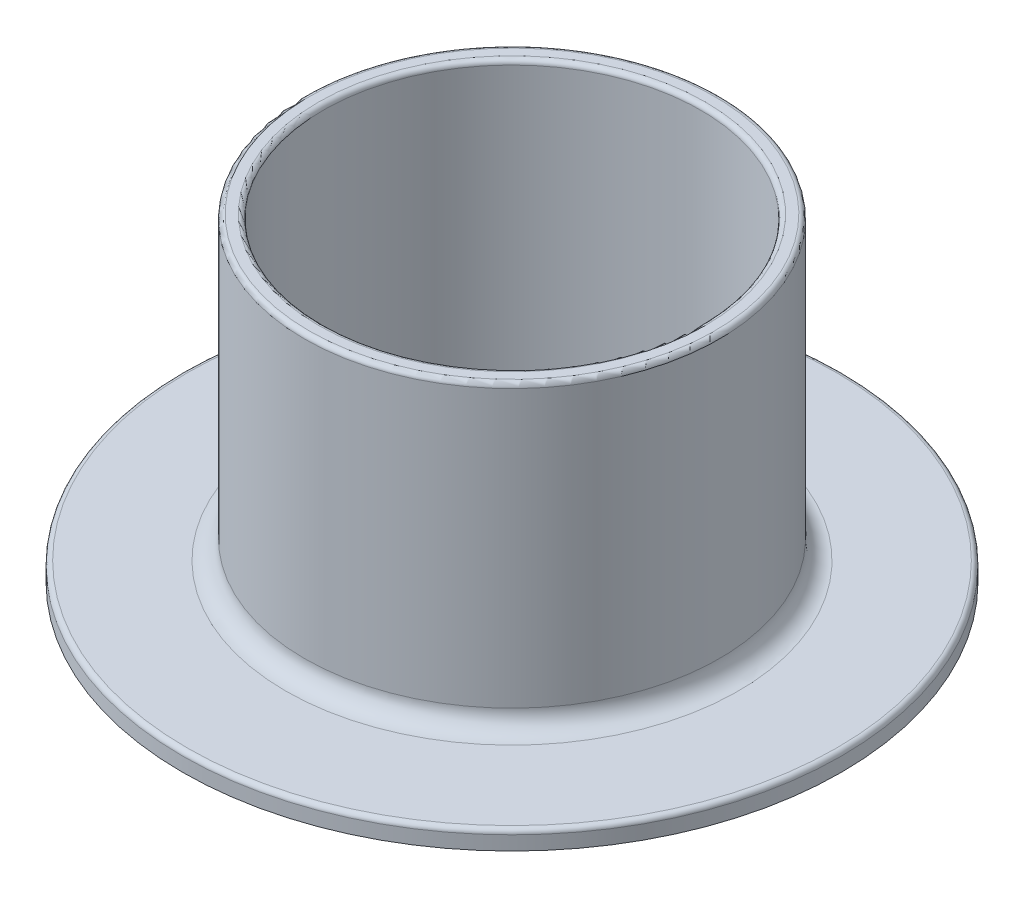
ISO-10303-21;
HEADER;
FILE_DESCRIPTION(('STEP AP214'),'2;1');
FILE_NAME('part.step','',(''),(''),'','','');
FILE_SCHEMA(('AUTOMOTIVE_DESIGN { 1 0 10303 214 1 1 1 1 }'));
ENDSEC;
DATA;
#1=APPLICATION_CONTEXT('core data for automotive mechanical design processes');
#2=APPLICATION_PROTOCOL_DEFINITION('international standard','automotive_design',2000,#1);
#3=PRODUCT_CONTEXT('',#1,'mechanical');
#4=PRODUCT('Part','Part','',(#3));
#5=PRODUCT_RELATED_PRODUCT_CATEGORY('part','',(#4));
#6=PRODUCT_DEFINITION_FORMATION('','',#4);
#7=PRODUCT_DEFINITION_CONTEXT('part definition',#1,'design');
#8=PRODUCT_DEFINITION('design','',#6,#7);
#9=PRODUCT_DEFINITION_SHAPE('','',#8);
#10=(LENGTH_UNIT() NAMED_UNIT(*) SI_UNIT(.MILLI.,.METRE.));
#11=(NAMED_UNIT(*) PLANE_ANGLE_UNIT() SI_UNIT($,.RADIAN.));
#12=(NAMED_UNIT(*) SI_UNIT($,.STERADIAN.) SOLID_ANGLE_UNIT());
#13=UNCERTAINTY_MEASURE_WITH_UNIT(LENGTH_MEASURE(1.E-05),#10,'distance_accuracy_value','');
#14=(GEOMETRIC_REPRESENTATION_CONTEXT(3) GLOBAL_UNCERTAINTY_ASSIGNED_CONTEXT((#13)) GLOBAL_UNIT_ASSIGNED_CONTEXT((#10,
#11,#12)) REPRESENTATION_CONTEXT('',''));
#15=CARTESIAN_POINT('',(0.,0.,0.));
#16=DIRECTION('',(0.,0.,1.));
#17=DIRECTION('',(1.,0.,0.));
#18=AXIS2_PLACEMENT_3D('',#15,#16,#17);
#19=CARTESIAN_POINT('',(35.125,0.,0.));
#20=DIRECTION('',(0.,1.,0.));
#21=DIRECTION('',(0.,0.,1.));
#22=AXIS2_PLACEMENT_3D('',#19,#20,#21);
#23=PLANE('',#22);
#24=CARTESIAN_POINT('',(0.,0.,0.));
#25=DIRECTION('',(0.,1.,0.));
#26=DIRECTION('',(0.,0.,1.));
#27=AXIS2_PLACEMENT_3D('',#24,#25,#26);
#28=CIRCLE('',#27,35.125);
#29=CARTESIAN_POINT('',(0.,0.,35.125));
#30=VERTEX_POINT('',#29);
#31=EDGE_CURVE('E64',#30,#30,#28,.T.);
#32=ORIENTED_EDGE('',*,*,#31,.F.);
#33=EDGE_LOOP('',(#32));
#34=FACE_BOUND('',#33,.T.);
#35=CARTESIAN_POINT('',(0.,0.,0.));
#36=DIRECTION('',(0.,1.,0.));
#37=DIRECTION('',(0.,0.,1.));
#38=AXIS2_PLACEMENT_3D('',#35,#36,#37);
#39=CIRCLE('',#38,20.125);
#40=CARTESIAN_POINT('',(0.,0.,20.125));
#41=VERTEX_POINT('',#40);
#42=EDGE_CURVE('E10',#41,#41,#39,.T.);
#43=ORIENTED_EDGE('',*,*,#42,.T.);
#44=EDGE_LOOP('',(#43));
#45=FACE_BOUND('',#44,.T.);
#46=ADVANCED_FACE('F30',(#34,#45),#23,.F.);
#47=CARTESIAN_POINT('',(0.,40.7647273937902,0.));
#48=DIRECTION('',(0.,1.,0.));
#49=DIRECTION('',(0.,0.,1.));
#50=AXIS2_PLACEMENT_3D('',#47,#48,#49);
#51=CYLINDRICAL_SURFACE('',#50,20.125);
#52=ORIENTED_EDGE('',*,*,#42,.F.);
#53=EDGE_LOOP('',(#52));
#54=FACE_BOUND('',#53,.T.);
#55=CARTESIAN_POINT('',(0.,33.5,0.));
#56=DIRECTION('',(0.,1.,0.));
#57=DIRECTION('',(0.,0.,1.));
#58=AXIS2_PLACEMENT_3D('',#55,#56,#57);
#59=CIRCLE('',#58,20.125);
#60=CARTESIAN_POINT('',(0.,33.5,20.125));
#61=VERTEX_POINT('',#60);
#62=EDGE_CURVE('E36',#61,#61,#59,.T.);
#63=ORIENTED_EDGE('',*,*,#62,.T.);
#64=EDGE_LOOP('',(#63));
#65=FACE_BOUND('',#64,.T.);
#66=ADVANCED_FACE('F71',(#54,#65),#51,.F.);
#67=CARTESIAN_POINT('',(0.,33.5,0.));
#68=DIRECTION('',(0.,1.,0.));
#69=DIRECTION('',(0.,0.,1.));
#70=AXIS2_PLACEMENT_3D('',#67,#68,#69);
#71=TOROIDAL_SURFACE('',#70,20.625,0.5);
#72=ORIENTED_EDGE('',*,*,#62,.F.);
#73=EDGE_LOOP('',(#72));
#74=FACE_BOUND('',#73,.T.);
#75=CARTESIAN_POINT('',(0.,34.,0.));
#76=DIRECTION('',(0.,1.,0.));
#77=DIRECTION('',(0.,0.,1.));
#78=AXIS2_PLACEMENT_3D('',#75,#76,#77);
#79=CIRCLE('',#78,20.625);
#80=CARTESIAN_POINT('',(0.,34.,20.625));
#81=VERTEX_POINT('',#80);
#82=EDGE_CURVE('E40',#81,#81,#79,.T.);
#83=ORIENTED_EDGE('',*,*,#82,.T.);
#84=EDGE_LOOP('',(#83));
#85=FACE_BOUND('',#84,.T.);
#86=ADVANCED_FACE('F75',(#74,#85),#71,.T.);
#87=CARTESIAN_POINT('',(20.625,34.,0.));
#88=DIRECTION('',(0.,-1.,0.));
#89=DIRECTION('',(0.,0.,-1.));
#90=AXIS2_PLACEMENT_3D('',#87,#88,#89);
#91=PLANE('',#90);
#92=ORIENTED_EDGE('',*,*,#82,.F.);
#93=EDGE_LOOP('',(#92));
#94=FACE_BOUND('',#93,.T.);
#95=CARTESIAN_POINT('',(0.,34.,0.));
#96=DIRECTION('',(0.,1.,0.));
#97=DIRECTION('',(0.,0.,1.));
#98=AXIS2_PLACEMENT_3D('',#95,#96,#97);
#99=CIRCLE('',#98,21.625);
#100=CARTESIAN_POINT('',(0.,34.,21.625));
#101=VERTEX_POINT('',#100);
#102=EDGE_CURVE('E44',#101,#101,#99,.T.);
#103=ORIENTED_EDGE('',*,*,#102,.T.);
#104=EDGE_LOOP('',(#103));
#105=FACE_BOUND('',#104,.T.);
#106=ADVANCED_FACE('F80',(#94,#105),#91,.F.);
#107=CARTESIAN_POINT('',(0.,33.5,0.));
#108=DIRECTION('',(0.,1.,0.));
#109=DIRECTION('',(0.,0.,1.));
#110=AXIS2_PLACEMENT_3D('',#107,#108,#109);
#111=TOROIDAL_SURFACE('',#110,21.625,0.5);
#112=ORIENTED_EDGE('',*,*,#102,.F.);
#113=EDGE_LOOP('',(#112));
#114=FACE_BOUND('',#113,.T.);
#115=CARTESIAN_POINT('',(0.,33.5,0.));
#116=DIRECTION('',(0.,1.,0.));
#117=DIRECTION('',(0.,0.,1.));
#118=AXIS2_PLACEMENT_3D('',#115,#116,#117);
#119=CIRCLE('',#118,22.125);
#120=CARTESIAN_POINT('',(0.,33.5,22.125));
#121=VERTEX_POINT('',#120);
#122=EDGE_CURVE('E49',#121,#121,#119,.T.);
#123=ORIENTED_EDGE('',*,*,#122,.T.);
#124=EDGE_LOOP('',(#123));
#125=FACE_BOUND('',#124,.T.);
#126=ADVANCED_FACE('F86',(#114,#125),#111,.T.);
#127=CARTESIAN_POINT('',(0.,40.7647273937902,0.));
#128=DIRECTION('',(0.,1.,0.));
#129=DIRECTION('',(0.,0.,1.));
#130=AXIS2_PLACEMENT_3D('',#127,#128,#129);
#131=CYLINDRICAL_SURFACE('',#130,22.125);
#132=ORIENTED_EDGE('',*,*,#122,.F.);
#133=EDGE_LOOP('',(#132));
#134=FACE_BOUND('',#133,.T.);
#135=CARTESIAN_POINT('',(0.,4.,0.));
#136=DIRECTION('',(0.,1.,0.));
#137=DIRECTION('',(0.,0.,1.));
#138=AXIS2_PLACEMENT_3D('',#135,#136,#137);
#139=CIRCLE('',#138,22.125);
#140=CARTESIAN_POINT('',(0.,4.,22.125));
#141=VERTEX_POINT('',#140);
#142=EDGE_CURVE('E52',#141,#141,#139,.T.);
#143=ORIENTED_EDGE('',*,*,#142,.T.);
#144=EDGE_LOOP('',(#143));
#145=FACE_BOUND('',#144,.T.);
#146=ADVANCED_FACE('F90',(#134,#145),#131,.T.);
#147=CARTESIAN_POINT('',(0.,4.,0.));
#148=DIRECTION('',(0.,1.,0.));
#149=DIRECTION('',(0.,0.,1.));
#150=AXIS2_PLACEMENT_3D('',#147,#148,#149);
#151=TOROIDAL_SURFACE('',#150,24.125,2.);
#152=ORIENTED_EDGE('',*,*,#142,.F.);
#153=EDGE_LOOP('',(#152));
#154=FACE_BOUND('',#153,.T.);
#155=CARTESIAN_POINT('',(0.,2.,0.));
#156=DIRECTION('',(0.,1.,0.));
#157=DIRECTION('',(0.,0.,1.));
#158=AXIS2_PLACEMENT_3D('',#155,#156,#157);
#159=CIRCLE('',#158,24.125);
#160=CARTESIAN_POINT('',(0.,2.,24.125));
#161=VERTEX_POINT('',#160);
#162=EDGE_CURVE('E55',#161,#161,#159,.T.);
#163=ORIENTED_EDGE('',*,*,#162,.T.);
#164=EDGE_LOOP('',(#163));
#165=FACE_BOUND('',#164,.T.);
#166=ADVANCED_FACE('F94',(#154,#165),#151,.F.);
#167=CARTESIAN_POINT('',(24.125,2.,0.));
#168=DIRECTION('',(0.,-1.,0.));
#169=DIRECTION('',(0.,0.,-1.));
#170=AXIS2_PLACEMENT_3D('',#167,#168,#169);
#171=PLANE('',#170);
#172=ORIENTED_EDGE('',*,*,#162,.F.);
#173=EDGE_LOOP('',(#172));
#174=FACE_BOUND('',#173,.T.);
#175=CARTESIAN_POINT('',(0.,2.,0.));
#176=DIRECTION('',(0.,1.,0.));
#177=DIRECTION('',(0.,0.,1.));
#178=AXIS2_PLACEMENT_3D('',#175,#176,#177);
#179=CIRCLE('',#178,34.625);
#180=CARTESIAN_POINT('',(0.,2.,34.625));
#181=VERTEX_POINT('',#180);
#182=EDGE_CURVE('E58',#181,#181,#179,.T.);
#183=ORIENTED_EDGE('',*,*,#182,.T.);
#184=EDGE_LOOP('',(#183));
#185=FACE_BOUND('',#184,.T.);
#186=ADVANCED_FACE('F98',(#174,#185),#171,.F.);
#187=CARTESIAN_POINT('',(0.,1.5,0.));
#188=DIRECTION('',(0.,1.,0.));
#189=DIRECTION('',(0.,0.,1.));
#190=AXIS2_PLACEMENT_3D('',#187,#188,#189);
#191=TOROIDAL_SURFACE('',#190,34.625,0.5);
#192=ORIENTED_EDGE('',*,*,#182,.F.);
#193=EDGE_LOOP('',(#192));
#194=FACE_BOUND('',#193,.T.);
#195=CARTESIAN_POINT('',(0.,1.5,0.));
#196=DIRECTION('',(0.,1.,0.));
#197=DIRECTION('',(0.,0.,1.));
#198=AXIS2_PLACEMENT_3D('',#195,#196,#197);
#199=CIRCLE('',#198,35.125);
#200=CARTESIAN_POINT('',(0.,1.5,35.125));
#201=VERTEX_POINT('',#200);
#202=EDGE_CURVE('E61',#201,#201,#199,.T.);
#203=ORIENTED_EDGE('',*,*,#202,.T.);
#204=EDGE_LOOP('',(#203));
#205=FACE_BOUND('',#204,.T.);
#206=ADVANCED_FACE('F102',(#194,#205),#191,.T.);
#207=CARTESIAN_POINT('',(0.,40.7647273937902,0.));
#208=DIRECTION('',(0.,1.,0.));
#209=DIRECTION('',(0.,0.,1.));
#210=AXIS2_PLACEMENT_3D('',#207,#208,#209);
#211=CYLINDRICAL_SURFACE('',#210,35.125);
#212=ORIENTED_EDGE('',*,*,#202,.F.);
#213=EDGE_LOOP('',(#212));
#214=FACE_BOUND('',#213,.T.);
#215=ORIENTED_EDGE('',*,*,#31,.T.);
#216=EDGE_LOOP('',(#215));
#217=FACE_BOUND('',#216,.T.);
#218=ADVANCED_FACE('F68',(#214,#217),#211,.T.);
#219=CLOSED_SHELL('',(#46,#66,#86,#106,#126,#146,#166,#186,#206,#218));
#220=MANIFOLD_SOLID_BREP('B2',#219);
#221=ADVANCED_BREP_SHAPE_REPRESENTATION('',(#18,#220),#14);
#222=SHAPE_DEFINITION_REPRESENTATION(#9,#221);
ENDSEC;
END-ISO-10303-21;
